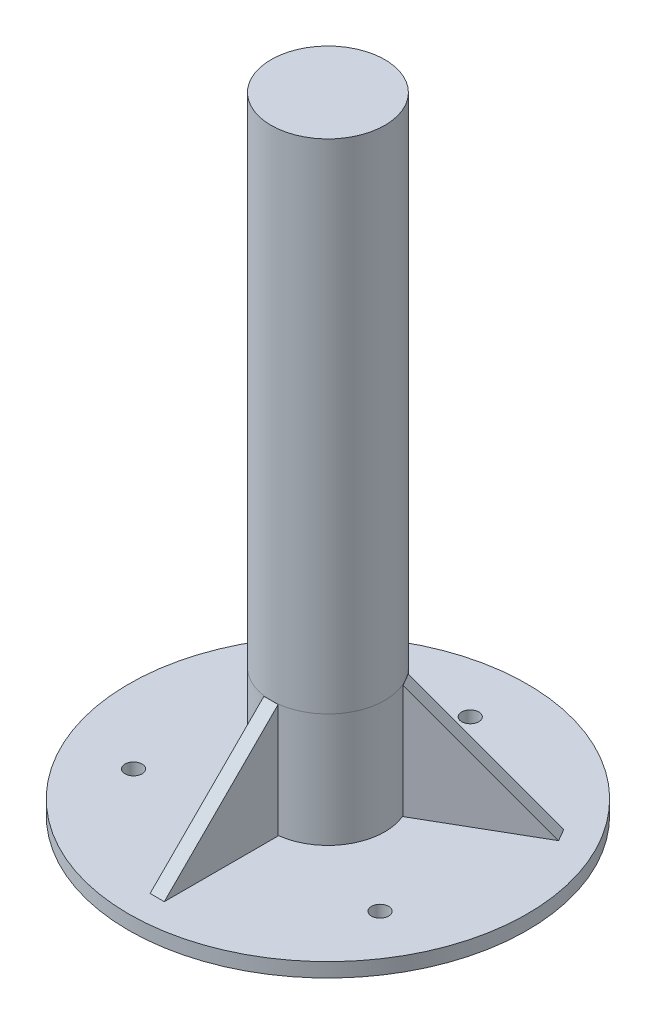
ISO-10303-21;
HEADER;
FILE_DESCRIPTION(('STEP AP214'),'2;1');
FILE_NAME('part.step','',(''),(''),'','','');
FILE_SCHEMA(('AUTOMOTIVE_DESIGN { 1 0 10303 214 1 1 1 1 }'));
ENDSEC;
DATA;
#1=APPLICATION_CONTEXT('core data for automotive mechanical design processes');
#2=APPLICATION_PROTOCOL_DEFINITION('international standard','automotive_design',2000,#1);
#3=PRODUCT_CONTEXT('',#1,'mechanical');
#4=PRODUCT('Part','Part','',(#3));
#5=PRODUCT_RELATED_PRODUCT_CATEGORY('part','',(#4));
#6=PRODUCT_DEFINITION_FORMATION('','',#4);
#7=PRODUCT_DEFINITION_CONTEXT('part definition',#1,'design');
#8=PRODUCT_DEFINITION('design','',#6,#7);
#9=PRODUCT_DEFINITION_SHAPE('','',#8);
#10=(LENGTH_UNIT() NAMED_UNIT(*) SI_UNIT(.MILLI.,.METRE.));
#11=(NAMED_UNIT(*) PLANE_ANGLE_UNIT() SI_UNIT($,.RADIAN.));
#12=(NAMED_UNIT(*) SI_UNIT($,.STERADIAN.) SOLID_ANGLE_UNIT());
#13=UNCERTAINTY_MEASURE_WITH_UNIT(LENGTH_MEASURE(1.E-05),#10,'distance_accuracy_value','');
#14=(GEOMETRIC_REPRESENTATION_CONTEXT(3) GLOBAL_UNCERTAINTY_ASSIGNED_CONTEXT((#13)) GLOBAL_UNIT_ASSIGNED_CONTEXT((#10,
#11,#12)) REPRESENTATION_CONTEXT('',''));
#15=CARTESIAN_POINT('',(0.,0.,0.));
#16=DIRECTION('',(0.,0.,1.));
#17=DIRECTION('',(1.,0.,0.));
#18=AXIS2_PLACEMENT_3D('',#15,#16,#17);
#19=CARTESIAN_POINT('',(-2.5,40.,20.));
#20=DIRECTION('',(0.,0.707106781186544,0.707106781186551));
#21=DIRECTION('',(0.,-0.707106781186551,0.707106781186544));
#22=AXIS2_PLACEMENT_3D('',#19,#20,#21);
#23=PLANE('',#22);
#24=DIRECTION('',(1.,0.,0.));
#25=VECTOR('',#24,1.);
#26=CARTESIAN_POINT('',(-2.5,0.,59.9999999999996));
#27=LINE('',#26,#25);
#28=CARTESIAN_POINT('',(-2.5,0.,59.9999999999996));
#29=VERTEX_POINT('',#28);
#30=CARTESIAN_POINT('',(2.5,0.,59.9999999999996));
#31=VERTEX_POINT('',#30);
#32=EDGE_CURVE('E48',#29,#31,#27,.T.);
#33=ORIENTED_EDGE('',*,*,#32,.T.);
#34=DIRECTION('',(0.,-0.707106781186551,0.707106781186544));
#35=VECTOR('',#34,1.);
#36=CARTESIAN_POINT('',(2.5,40.,20.));
#37=LINE('',#36,#35);
#38=CARTESIAN_POINT('',(2.5,40.,20.));
#39=VERTEX_POINT('',#38);
#40=EDGE_CURVE('E79',#39,#31,#37,.T.);
#41=ORIENTED_EDGE('',*,*,#40,.F.);
#42=DIRECTION('',(1.,0.,0.));
#43=VECTOR('',#42,1.);
#44=CARTESIAN_POINT('',(-2.5,40.,20.));
#45=LINE('',#44,#43);
#46=CARTESIAN_POINT('',(-2.5,40.,20.));
#47=VERTEX_POINT('',#46);
#48=EDGE_CURVE('E12',#47,#39,#45,.T.);
#49=ORIENTED_EDGE('',*,*,#48,.F.);
#50=DIRECTION('',(0.,-0.707106781186551,0.707106781186544));
#51=VECTOR('',#50,1.);
#52=CARTESIAN_POINT('',(-2.5,40.,20.));
#53=LINE('',#52,#51);
#54=EDGE_CURVE('E80',#47,#29,#53,.T.);
#55=ORIENTED_EDGE('',*,*,#54,.T.);
#56=EDGE_LOOP('',(#33,#41,#49,#55));
#57=FACE_BOUND('',#56,.T.);
#58=ADVANCED_FACE('F45',(#57),#23,.T.);
#59=CARTESIAN_POINT('',(-2.5,0.,20.));
#60=DIRECTION('',(0.,0.,-1.));
#61=DIRECTION('',(-1.,0.,0.));
#62=AXIS2_PLACEMENT_3D('',#59,#60,#61);
#63=PLANE('',#62);
#64=ORIENTED_EDGE('',*,*,#48,.T.);
#65=DIRECTION('',(0.,1.,0.));
#66=VECTOR('',#65,1.);
#67=CARTESIAN_POINT('',(2.5,0.,20.));
#68=LINE('',#67,#66);
#69=CARTESIAN_POINT('',(2.5,0.,20.));
#70=VERTEX_POINT('',#69);
#71=EDGE_CURVE('E89',#70,#39,#68,.T.);
#72=ORIENTED_EDGE('',*,*,#71,.F.);
#73=DIRECTION('',(1.,0.,0.));
#74=VECTOR('',#73,1.);
#75=CARTESIAN_POINT('',(-2.5,0.,20.));
#76=LINE('',#75,#74);
#77=CARTESIAN_POINT('',(-2.5,0.,20.));
#78=VERTEX_POINT('',#77);
#79=EDGE_CURVE('E53',#78,#70,#76,.T.);
#80=ORIENTED_EDGE('',*,*,#79,.F.);
#81=DIRECTION('',(0.,1.,0.));
#82=VECTOR('',#81,1.);
#83=CARTESIAN_POINT('',(-2.5,0.,20.));
#84=LINE('',#83,#82);
#85=EDGE_CURVE('E83',#78,#47,#84,.T.);
#86=ORIENTED_EDGE('',*,*,#85,.T.);
#87=EDGE_LOOP('',(#64,#72,#80,#86));
#88=FACE_BOUND('',#87,.T.);
#89=ADVANCED_FACE('F99',(#88),#63,.T.);
#90=CARTESIAN_POINT('',(-2.5,0.,59.9999999999996));
#91=DIRECTION('',(0.,-1.,0.));
#92=DIRECTION('',(0.,0.,-1.));
#93=AXIS2_PLACEMENT_3D('',#90,#91,#92);
#94=PLANE('',#93);
#95=ORIENTED_EDGE('',*,*,#79,.T.);
#96=DIRECTION('',(0.,0.,-1.));
#97=VECTOR('',#96,1.);
#98=CARTESIAN_POINT('',(2.5,0.,59.9999999999996));
#99=LINE('',#98,#97);
#100=EDGE_CURVE('E85',#31,#70,#99,.T.);
#101=ORIENTED_EDGE('',*,*,#100,.F.);
#102=ORIENTED_EDGE('',*,*,#32,.F.);
#103=DIRECTION('',(0.,0.,-1.));
#104=VECTOR('',#103,1.);
#105=CARTESIAN_POINT('',(-2.5,0.,59.9999999999996));
#106=LINE('',#105,#104);
#107=EDGE_CURVE('E96',#29,#78,#106,.T.);
#108=ORIENTED_EDGE('',*,*,#107,.T.);
#109=EDGE_LOOP('',(#95,#101,#102,#108));
#110=FACE_BOUND('',#109,.T.);
#111=ADVANCED_FACE('F86',(#110),#94,.T.);
#112=CARTESIAN_POINT('',(-2.5,0.,0.));
#113=DIRECTION('',(1.,0.,0.));
#114=DIRECTION('',(0.,0.,-1.));
#115=AXIS2_PLACEMENT_3D('',#112,#113,#114);
#116=PLANE('',#115);
#117=ORIENTED_EDGE('',*,*,#54,.F.);
#118=ORIENTED_EDGE('',*,*,#85,.F.);
#119=ORIENTED_EDGE('',*,*,#107,.F.);
#120=EDGE_LOOP('',(#117,#118,#119));
#121=FACE_BOUND('',#120,.T.);
#122=ADVANCED_FACE('F101',(#121),#116,.F.);
#123=CARTESIAN_POINT('',(2.5,0.,0.));
#124=DIRECTION('',(1.,0.,0.));
#125=DIRECTION('',(0.,0.,-1.));
#126=AXIS2_PLACEMENT_3D('',#123,#124,#125);
#127=PLANE('',#126);
#128=ORIENTED_EDGE('',*,*,#40,.T.);
#129=ORIENTED_EDGE('',*,*,#100,.T.);
#130=ORIENTED_EDGE('',*,*,#71,.T.);
#131=EDGE_LOOP('',(#128,#129,#130));
#132=FACE_BOUND('',#131,.T.);
#133=ADVANCED_FACE('F91',(#132),#127,.T.);
#134=CLOSED_SHELL('',(#58,#89,#111,#122,#133));
#135=MANIFOLD_SOLID_BREP('B2',#134);
#136=CARTESIAN_POINT('',(0.,215.,0.));
#137=DIRECTION('',(0.,-1.,0.));
#138=DIRECTION('',(0.,0.,-1.));
#139=AXIS2_PLACEMENT_3D('',#136,#137,#138);
#140=CYLINDRICAL_SURFACE('',#139,20.);
#141=CARTESIAN_POINT('',(0.,215.,0.));
#142=DIRECTION('',(0.,1.,0.));
#143=DIRECTION('',(0.,0.,1.));
#144=AXIS2_PLACEMENT_3D('',#141,#142,#143);
#145=CIRCLE('',#144,20.);
#146=CARTESIAN_POINT('',(0.,215.,20.));
#147=VERTEX_POINT('',#146);
#148=EDGE_CURVE('E43',#147,#147,#145,.T.);
#149=ORIENTED_EDGE('',*,*,#148,.F.);
#150=EDGE_LOOP('',(#149));
#151=FACE_BOUND('',#150,.T.);
#152=CARTESIAN_POINT('',(0.,40.,0.));
#153=DIRECTION('',(0.,1.,0.));
#154=DIRECTION('',(0.,0.,1.));
#155=AXIS2_PLACEMENT_3D('',#152,#153,#154);
#156=CIRCLE('',#155,20.);
#157=CARTESIAN_POINT('',(-17.3205080756887,40.,-10.0000000000001));
#158=VERTEX_POINT('',#157);
#159=CARTESIAN_POINT('',(17.3205080756889,40.,-9.99999999999984));
#160=VERTEX_POINT('',#159);
#161=EDGE_CURVE('E153',#158,#160,#156,.T.);
#162=ORIENTED_EDGE('',*,*,#161,.T.);
#163=EDGE_CURVE('E163',#160,#158,#156,.T.);
#164=ORIENTED_EDGE('',*,*,#163,.T.);
#165=EDGE_LOOP('',(#162,#164));
#166=FACE_BOUND('',#165,.T.);
#167=ADVANCED_FACE('F150',(#151,#166),#140,.T.);
#168=CARTESIAN_POINT('',(0.,215.,0.));
#169=DIRECTION('',(0.,1.,0.));
#170=DIRECTION('',(0.,0.,1.));
#171=AXIS2_PLACEMENT_3D('',#168,#169,#170);
#172=PLANE('',#171);
#173=ORIENTED_EDGE('',*,*,#148,.T.);
#174=EDGE_LOOP('',(#173));
#175=FACE_BOUND('',#174,.T.);
#176=ADVANCED_FACE('F168',(#175),#172,.T.);
#177=CARTESIAN_POINT('',(0.,40.,0.));
#178=DIRECTION('',(0.,1.,0.));
#179=DIRECTION('',(0.,0.,1.));
#180=AXIS2_PLACEMENT_3D('',#177,#178,#179);
#181=PLANE('',#180);
#182=ORIENTED_EDGE('',*,*,#161,.F.);
#183=ORIENTED_EDGE('',*,*,#163,.F.);
#184=EDGE_LOOP('',(#182,#183));
#185=FACE_BOUND('',#184,.T.);
#186=ADVANCED_FACE('F166',(#185),#181,.F.);
#187=CLOSED_SHELL('',(#167,#176,#186));
#188=MANIFOLD_SOLID_BREP('B6',#187);
#189=CARTESIAN_POINT('',(0.,40.,0.));
#190=DIRECTION('',(0.,-1.,0.));
#191=DIRECTION('',(0.,0.,-1.));
#192=AXIS2_PLACEMENT_3D('',#189,#190,#191);
#193=CYLINDRICAL_SURFACE('',#192,20.);
#194=CARTESIAN_POINT('',(0.,0.,0.));
#195=DIRECTION('',(0.,1.,0.));
#196=DIRECTION('',(0.,0.,1.));
#197=AXIS2_PLACEMENT_3D('',#194,#195,#196);
#198=CIRCLE('',#197,20.);
#199=CARTESIAN_POINT('',(0.,0.,20.));
#200=VERTEX_POINT('',#199);
#201=EDGE_CURVE('E207',#200,#200,#198,.T.);
#202=ORIENTED_EDGE('',*,*,#201,.T.);
#203=EDGE_LOOP('',(#202));
#204=FACE_BOUND('',#203,.T.);
#205=CARTESIAN_POINT('',(0.,40.,0.));
#206=DIRECTION('',(0.,1.,0.));
#207=DIRECTION('',(0.,0.,1.));
#208=AXIS2_PLACEMENT_3D('',#205,#206,#207);
#209=CIRCLE('',#208,20.);
#210=CARTESIAN_POINT('',(0.,40.,20.));
#211=VERTEX_POINT('',#210);
#212=EDGE_CURVE('E149',#211,#211,#209,.T.);
#213=ORIENTED_EDGE('',*,*,#212,.F.);
#214=EDGE_LOOP('',(#213));
#215=FACE_BOUND('',#214,.T.);
#216=ADVANCED_FACE('F204',(#204,#215),#193,.T.);
#217=CARTESIAN_POINT('',(0.,40.,0.));
#218=DIRECTION('',(0.,1.,0.));
#219=DIRECTION('',(0.,0.,1.));
#220=AXIS2_PLACEMENT_3D('',#217,#218,#219);
#221=PLANE('',#220);
#222=ORIENTED_EDGE('',*,*,#212,.T.);
#223=EDGE_LOOP('',(#222));
#224=FACE_BOUND('',#223,.T.);
#225=ADVANCED_FACE('F220',(#224),#221,.T.);
#226=CARTESIAN_POINT('',(0.,0.,0.));
#227=DIRECTION('',(0.,1.,0.));
#228=DIRECTION('',(0.,0.,1.));
#229=AXIS2_PLACEMENT_3D('',#226,#227,#228);
#230=PLANE('',#229);
#231=ORIENTED_EDGE('',*,*,#201,.F.);
#232=EDGE_LOOP('',(#231));
#233=FACE_BOUND('',#232,.T.);
#234=ADVANCED_FACE('F218',(#233),#230,.F.);
#235=CLOSED_SHELL('',(#216,#225,#234));
#236=MANIFOLD_SOLID_BREP('B37',#235);
#237=CARTESIAN_POINT('',(0.,0.,0.));
#238=DIRECTION('',(0.,1.,0.));
#239=DIRECTION('',(0.,0.,1.));
#240=AXIS2_PLACEMENT_3D('',#237,#238,#239);
#241=PLANE('',#240);
#242=CARTESIAN_POINT('',(0.,0.,-50.));
#243=DIRECTION('',(0.,1.,0.));
#244=DIRECTION('',(0.,0.,1.));
#245=AXIS2_PLACEMENT_3D('',#242,#243,#244);
#246=CIRCLE('',#245,3.);
#247=CARTESIAN_POINT('',(0.,0.,-47.));
#248=VERTEX_POINT('',#247);
#249=EDGE_CURVE('E415',#248,#248,#246,.T.);
#250=ORIENTED_EDGE('',*,*,#249,.F.);
#251=EDGE_LOOP('',(#250));
#252=FACE_BOUND('',#251,.T.);
#253=CARTESIAN_POINT('',(43.3012701892241,0.,24.9999999999988));
#254=DIRECTION('',(0.,1.,0.));
#255=DIRECTION('',(0.,0.,1.));
#256=AXIS2_PLACEMENT_3D('',#253,#254,#255);
#257=CIRCLE('',#256,3.0000000000019);
#258=CARTESIAN_POINT('',(43.3012701892241,0.,28.0000000000007));
#259=VERTEX_POINT('',#258);
#260=EDGE_CURVE('E420',#259,#259,#257,.T.);
#261=ORIENTED_EDGE('',*,*,#260,.F.);
#262=EDGE_LOOP('',(#261));
#263=FACE_BOUND('',#262,.T.);
#264=CARTESIAN_POINT('',(-43.3012701892198,0.,25.0000000000012));
#265=DIRECTION('',(0.,1.,0.));
#266=DIRECTION('',(0.,0.,1.));
#267=AXIS2_PLACEMENT_3D('',#264,#265,#266);
#268=CIRCLE('',#267,3.00000000000286);
#269=CARTESIAN_POINT('',(-43.3012701892198,0.,28.0000000000041));
#270=VERTEX_POINT('',#269);
#271=EDGE_CURVE('E428',#270,#270,#268,.T.);
#272=ORIENTED_EDGE('',*,*,#271,.F.);
#273=EDGE_LOOP('',(#272));
#274=FACE_BOUND('',#273,.T.);
#275=CARTESIAN_POINT('',(0.,0.,0.));
#276=DIRECTION('',(0.,1.,0.));
#277=DIRECTION('',(0.,0.,1.));
#278=AXIS2_PLACEMENT_3D('',#275,#276,#277);
#279=CIRCLE('',#278,70.);
#280=CARTESIAN_POINT('',(0.,0.,70.));
#281=VERTEX_POINT('',#280);
#282=EDGE_CURVE('E248',#281,#281,#279,.T.);
#283=ORIENTED_EDGE('',*,*,#282,.T.);
#284=EDGE_LOOP('',(#283));
#285=FACE_BOUND('',#284,.T.);
#286=DIRECTION('',(-0.500000000000004,0.,0.866025403784436));
#287=VECTOR('',#286,1.);
#288=CARTESIAN_POINT('',(-50.7115242270658,0.,-32.1650635094611));
#289=LINE('',#288,#287);
#290=CARTESIAN_POINT('',(-50.7115242270658,0.,-32.1650635094611));
#291=VERTEX_POINT('',#290);
#292=CARTESIAN_POINT('',(-53.2115242270658,0.,-27.8349364905389));
#293=VERTEX_POINT('',#292);
#294=EDGE_CURVE('E323',#291,#293,#289,.T.);
#295=ORIENTED_EDGE('',*,*,#294,.F.);
#296=DIRECTION('',(0.866025403784436,0.,0.500000000000004));
#297=VECTOR('',#296,1.);
#298=CARTESIAN_POINT('',(-50.7115242270658,0.,-32.1650635094611));
#299=LINE('',#298,#297);
#300=CARTESIAN_POINT('',(-16.0705080756887,0.,-12.1650635094612));
#301=VERTEX_POINT('',#300);
#302=EDGE_CURVE('E346',#291,#301,#299,.T.);
#303=ORIENTED_EDGE('',*,*,#302,.T.);
#304=DIRECTION('',(-0.500000000000004,0.,0.866025403784436));
#305=VECTOR('',#304,1.);
#306=CARTESIAN_POINT('',(-16.0705080756887,0.,-12.1650635094612));
#307=LINE('',#306,#305);
#308=CARTESIAN_POINT('',(-18.5705080756887,0.,-7.83493649053899));
#309=VERTEX_POINT('',#308);
#310=EDGE_CURVE('E338',#301,#309,#307,.T.);
#311=ORIENTED_EDGE('',*,*,#310,.T.);
#312=DIRECTION('',(0.866025403784436,0.,0.500000000000004));
#313=VECTOR('',#312,1.);
#314=CARTESIAN_POINT('',(-53.2115242270658,0.,-27.8349364905389));
#315=LINE('',#314,#313);
#316=EDGE_CURVE('E343',#293,#309,#315,.T.);
#317=ORIENTED_EDGE('',*,*,#316,.F.);
#318=EDGE_LOOP('',(#295,#303,#311,#317));
#319=FACE_BOUND('',#318,.T.);
#320=DIRECTION('',(-0.499999999999992,0.,-0.866025403784443));
#321=VECTOR('',#320,1.);
#322=CARTESIAN_POINT('',(53.2115242270662,0.,-27.8349364905382));
#323=LINE('',#322,#321);
#324=CARTESIAN_POINT('',(53.2115242270662,0.,-27.8349364905382));
#325=VERTEX_POINT('',#324);
#326=CARTESIAN_POINT('',(50.7115242270662,0.,-32.1650635094604));
#327=VERTEX_POINT('',#326);
#328=EDGE_CURVE('E259',#325,#327,#323,.T.);
#329=ORIENTED_EDGE('',*,*,#328,.F.);
#330=DIRECTION('',(-0.866025403784443,0.,0.499999999999992));
#331=VECTOR('',#330,1.);
#332=CARTESIAN_POINT('',(53.2115242270662,0.,-27.8349364905382));
#333=LINE('',#332,#331);
#334=CARTESIAN_POINT('',(18.5705080756888,0.,-7.83493649053873));
#335=VERTEX_POINT('',#334);
#336=EDGE_CURVE('E264',#325,#335,#333,.T.);
#337=ORIENTED_EDGE('',*,*,#336,.T.);
#338=DIRECTION('',(-0.499999999999992,0.,-0.866025403784443));
#339=VECTOR('',#338,1.);
#340=CARTESIAN_POINT('',(18.5705080756888,0.,-7.83493649053873));
#341=LINE('',#340,#339);
#342=CARTESIAN_POINT('',(16.0705080756889,0.,-12.1650635094609));
#343=VERTEX_POINT('',#342);
#344=EDGE_CURVE('E315',#335,#343,#341,.T.);
#345=ORIENTED_EDGE('',*,*,#344,.T.);
#346=DIRECTION('',(-0.866025403784443,0.,0.499999999999992));
#347=VECTOR('',#346,1.);
#348=CARTESIAN_POINT('',(50.7115242270662,0.,-32.1650635094604));
#349=LINE('',#348,#347);
#350=EDGE_CURVE('E314',#327,#343,#349,.T.);
#351=ORIENTED_EDGE('',*,*,#350,.F.);
#352=EDGE_LOOP('',(#329,#337,#345,#351));
#353=FACE_BOUND('',#352,.T.);
#354=ADVANCED_FACE('F244',(#252,#263,#274,#285,#319,#353),#241,.T.);
#355=CARTESIAN_POINT('',(0.,-5.,0.));
#356=DIRECTION('',(0.,1.,0.));
#357=DIRECTION('',(0.,0.,1.));
#358=AXIS2_PLACEMENT_3D('',#355,#356,#357);
#359=CYLINDRICAL_SURFACE('',#358,70.);
#360=CARTESIAN_POINT('',(0.,-5.,0.));
#361=DIRECTION('',(0.,1.,0.));
#362=DIRECTION('',(0.,0.,1.));
#363=AXIS2_PLACEMENT_3D('',#360,#361,#362);
#364=CIRCLE('',#363,70.);
#365=CARTESIAN_POINT('',(0.,-5.,70.));
#366=VERTEX_POINT('',#365);
#367=EDGE_CURVE('E202',#366,#366,#364,.T.);
#368=ORIENTED_EDGE('',*,*,#367,.T.);
#369=EDGE_LOOP('',(#368));
#370=FACE_BOUND('',#369,.T.);
#371=ORIENTED_EDGE('',*,*,#282,.F.);
#372=EDGE_LOOP('',(#371));
#373=FACE_BOUND('',#372,.T.);
#374=ADVANCED_FACE('F246',(#370,#373),#359,.T.);
#375=CARTESIAN_POINT('',(0.,-5.,0.));
#376=DIRECTION('',(0.,1.,0.));
#377=DIRECTION('',(0.,0.,1.));
#378=AXIS2_PLACEMENT_3D('',#375,#376,#377);
#379=PLANE('',#378);
#380=CARTESIAN_POINT('',(0.,-5.,-50.));
#381=DIRECTION('',(0.,1.,0.));
#382=DIRECTION('',(0.,0.,1.));
#383=AXIS2_PLACEMENT_3D('',#380,#381,#382);
#384=CIRCLE('',#383,3.);
#385=CARTESIAN_POINT('',(0.,-5.,-47.));
#386=VERTEX_POINT('',#385);
#387=EDGE_CURVE('E413',#386,#386,#384,.T.);
#388=ORIENTED_EDGE('',*,*,#387,.T.);
#389=EDGE_LOOP('',(#388));
#390=FACE_BOUND('',#389,.T.);
#391=CARTESIAN_POINT('',(43.3012701892241,-5.,24.9999999999988));
#392=DIRECTION('',(0.,1.,0.));
#393=DIRECTION('',(0.,0.,1.));
#394=AXIS2_PLACEMENT_3D('',#391,#392,#393);
#395=CIRCLE('',#394,3.0000000000019);
#396=CARTESIAN_POINT('',(43.3012701892241,-5.,28.0000000000007));
#397=VERTEX_POINT('',#396);
#398=EDGE_CURVE('E416',#397,#397,#395,.T.);
#399=ORIENTED_EDGE('',*,*,#398,.T.);
#400=EDGE_LOOP('',(#399));
#401=FACE_BOUND('',#400,.T.);
#402=CARTESIAN_POINT('',(-43.3012701892198,-5.,25.0000000000012));
#403=DIRECTION('',(0.,1.,0.));
#404=DIRECTION('',(0.,0.,1.));
#405=AXIS2_PLACEMENT_3D('',#402,#403,#404);
#406=CIRCLE('',#405,3.00000000000286);
#407=CARTESIAN_POINT('',(-43.3012701892198,-5.,28.0000000000041));
#408=VERTEX_POINT('',#407);
#409=EDGE_CURVE('E425',#408,#408,#406,.T.);
#410=ORIENTED_EDGE('',*,*,#409,.T.);
#411=EDGE_LOOP('',(#410));
#412=FACE_BOUND('',#411,.T.);
#413=ORIENTED_EDGE('',*,*,#367,.F.);
#414=EDGE_LOOP('',(#413));
#415=FACE_BOUND('',#414,.T.);
#416=ADVANCED_FACE('F355',(#390,#401,#412,#415),#379,.F.);
#417=CARTESIAN_POINT('',(-16.0705080756887,40.,-12.1650635094612));
#418=DIRECTION('',(-0.612372435695796,0.707106781186544,-0.353553390593279));
#419=DIRECTION('',(-0.61237243569579,-0.707106781186551,-0.353553390593275));
#420=AXIS2_PLACEMENT_3D('',#417,#418,#419);
#421=PLANE('',#420);
#422=ORIENTED_EDGE('',*,*,#294,.T.);
#423=DIRECTION('',(-0.61237243569579,-0.707106781186551,-0.353553390593275));
#424=VECTOR('',#423,1.);
#425=CARTESIAN_POINT('',(-18.5705080756887,40.,-7.83493649053899));
#426=LINE('',#425,#424);
#427=CARTESIAN_POINT('',(-18.5705080756887,40.,-7.83493649053899));
#428=VERTEX_POINT('',#427);
#429=EDGE_CURVE('E326',#428,#293,#426,.T.);
#430=ORIENTED_EDGE('',*,*,#429,.F.);
#431=DIRECTION('',(-0.500000000000004,0.,0.866025403784436));
#432=VECTOR('',#431,1.);
#433=CARTESIAN_POINT('',(-16.0705080756887,40.,-12.1650635094612));
#434=LINE('',#433,#432);
#435=CARTESIAN_POINT('',(-16.0705080756887,40.,-12.1650635094612));
#436=VERTEX_POINT('',#435);
#437=EDGE_CURVE('E329',#436,#428,#434,.T.);
#438=ORIENTED_EDGE('',*,*,#437,.F.);
#439=DIRECTION('',(-0.61237243569579,-0.707106781186551,-0.353553390593275));
#440=VECTOR('',#439,1.);
#441=CARTESIAN_POINT('',(-16.0705080756887,40.,-12.1650635094612));
#442=LINE('',#441,#440);
#443=EDGE_CURVE('E332',#436,#291,#442,.T.);
#444=ORIENTED_EDGE('',*,*,#443,.T.);
#445=EDGE_LOOP('',(#422,#430,#438,#444));
#446=FACE_BOUND('',#445,.T.);
#447=ADVANCED_FACE('F361',(#446),#421,.T.);
#448=CARTESIAN_POINT('',(-16.0705080756887,0.,-12.1650635094612));
#449=DIRECTION('',(0.866025403784436,0.,0.500000000000004));
#450=DIRECTION('',(0.500000000000004,0.,-0.866025403784436));
#451=AXIS2_PLACEMENT_3D('',#448,#449,#450);
#452=PLANE('',#451);
#453=ORIENTED_EDGE('',*,*,#437,.T.);
#454=DIRECTION('',(0.,1.,0.));
#455=VECTOR('',#454,1.);
#456=CARTESIAN_POINT('',(-18.5705080756887,0.,-7.83493649053899));
#457=LINE('',#456,#455);
#458=EDGE_CURVE('E335',#309,#428,#457,.T.);
#459=ORIENTED_EDGE('',*,*,#458,.F.);
#460=ORIENTED_EDGE('',*,*,#310,.F.);
#461=DIRECTION('',(0.,1.,0.));
#462=VECTOR('',#461,1.);
#463=CARTESIAN_POINT('',(-16.0705080756887,0.,-12.1650635094612));
#464=LINE('',#463,#462);
#465=EDGE_CURVE('E340',#301,#436,#464,.T.);
#466=ORIENTED_EDGE('',*,*,#465,.T.);
#467=EDGE_LOOP('',(#453,#459,#460,#466));
#468=FACE_BOUND('',#467,.T.);
#469=ADVANCED_FACE('F379',(#468),#452,.T.);
#470=CARTESIAN_POINT('',(1.25000000000001,0.,-2.16506350946109));
#471=DIRECTION('',(-0.500000000000004,0.,0.866025403784436));
#472=DIRECTION('',(0.866025403784436,0.,0.500000000000004));
#473=AXIS2_PLACEMENT_3D('',#470,#471,#472);
#474=PLANE('',#473);
#475=ORIENTED_EDGE('',*,*,#443,.F.);
#476=ORIENTED_EDGE('',*,*,#465,.F.);
#477=ORIENTED_EDGE('',*,*,#302,.F.);
#478=EDGE_LOOP('',(#475,#476,#477));
#479=FACE_BOUND('',#478,.T.);
#480=ADVANCED_FACE('F375',(#479),#474,.F.);
#481=CARTESIAN_POINT('',(-1.25000000000001,0.,2.16506350946109));
#482=DIRECTION('',(-0.500000000000004,0.,0.866025403784436));
#483=DIRECTION('',(0.866025403784436,0.,0.500000000000004));
#484=AXIS2_PLACEMENT_3D('',#481,#482,#483);
#485=PLANE('',#484);
#486=ORIENTED_EDGE('',*,*,#429,.T.);
#487=ORIENTED_EDGE('',*,*,#316,.T.);
#488=ORIENTED_EDGE('',*,*,#458,.T.);
#489=EDGE_LOOP('',(#486,#487,#488));
#490=FACE_BOUND('',#489,.T.);
#491=ADVANCED_FACE('F364',(#490),#485,.T.);
#492=CARTESIAN_POINT('',(18.5705080756888,40.,-7.83493649053873));
#493=DIRECTION('',(0.612372435695801,0.707106781186544,-0.35355339059327));
#494=DIRECTION('',(0.612372435695794,-0.707106781186551,-0.353553390593266));
#495=AXIS2_PLACEMENT_3D('',#492,#493,#494);
#496=PLANE('',#495);
#497=ORIENTED_EDGE('',*,*,#328,.T.);
#498=DIRECTION('',(0.612372435695794,-0.707106781186551,-0.353553390593266));
#499=VECTOR('',#498,1.);
#500=CARTESIAN_POINT('',(16.0705080756889,40.,-12.1650635094609));
#501=LINE('',#500,#499);
#502=CARTESIAN_POINT('',(16.0705080756889,40.,-12.1650635094609));
#503=VERTEX_POINT('',#502);
#504=EDGE_CURVE('E295',#503,#327,#501,.T.);
#505=ORIENTED_EDGE('',*,*,#504,.F.);
#506=DIRECTION('',(-0.499999999999992,0.,-0.866025403784443));
#507=VECTOR('',#506,1.);
#508=CARTESIAN_POINT('',(18.5705080756888,40.,-7.83493649053873));
#509=LINE('',#508,#507);
#510=CARTESIAN_POINT('',(18.5705080756888,40.,-7.83493649053873));
#511=VERTEX_POINT('',#510);
#512=EDGE_CURVE('E298',#511,#503,#509,.T.);
#513=ORIENTED_EDGE('',*,*,#512,.F.);
#514=DIRECTION('',(0.612372435695794,-0.707106781186551,-0.353553390593266));
#515=VECTOR('',#514,1.);
#516=CARTESIAN_POINT('',(18.5705080756888,40.,-7.83493649053873));
#517=LINE('',#516,#515);
#518=EDGE_CURVE('E311',#511,#325,#517,.T.);
#519=ORIENTED_EDGE('',*,*,#518,.T.);
#520=EDGE_LOOP('',(#497,#505,#513,#519));
#521=FACE_BOUND('',#520,.T.);
#522=ADVANCED_FACE('F297',(#521),#496,.T.);
#523=CARTESIAN_POINT('',(18.5705080756888,0.,-7.83493649053873));
#524=DIRECTION('',(-0.866025403784443,0.,0.499999999999992));
#525=DIRECTION('',(0.499999999999992,0.,0.866025403784443));
#526=AXIS2_PLACEMENT_3D('',#523,#524,#525);
#527=PLANE('',#526);
#528=ORIENTED_EDGE('',*,*,#512,.T.);
#529=DIRECTION('',(0.,1.,0.));
#530=VECTOR('',#529,1.);
#531=CARTESIAN_POINT('',(16.0705080756889,0.,-12.1650635094609));
#532=LINE('',#531,#530);
#533=EDGE_CURVE('E308',#343,#503,#532,.T.);
#534=ORIENTED_EDGE('',*,*,#533,.F.);
#535=ORIENTED_EDGE('',*,*,#344,.F.);
#536=DIRECTION('',(0.,1.,0.));
#537=VECTOR('',#536,1.);
#538=CARTESIAN_POINT('',(18.5705080756888,0.,-7.83493649053873));
#539=LINE('',#538,#537);
#540=EDGE_CURVE('E310',#335,#511,#539,.T.);
#541=ORIENTED_EDGE('',*,*,#540,.T.);
#542=EDGE_LOOP('',(#528,#534,#535,#541));
#543=FACE_BOUND('',#542,.T.);
#544=ADVANCED_FACE('F307',(#543),#527,.T.);
#545=CARTESIAN_POINT('',(1.24999999999998,0.,2.16506350946111));
#546=DIRECTION('',(-0.499999999999992,0.,-0.866025403784443));
#547=DIRECTION('',(-0.866025403784443,0.,0.499999999999992));
#548=AXIS2_PLACEMENT_3D('',#545,#546,#547);
#549=PLANE('',#548);
#550=ORIENTED_EDGE('',*,*,#518,.F.);
#551=ORIENTED_EDGE('',*,*,#540,.F.);
#552=ORIENTED_EDGE('',*,*,#336,.F.);
#553=EDGE_LOOP('',(#550,#551,#552));
#554=FACE_BOUND('',#553,.T.);
#555=ADVANCED_FACE('F390',(#554),#549,.F.);
#556=CARTESIAN_POINT('',(-1.24999999999998,0.,-2.16506350946111));
#557=DIRECTION('',(-0.499999999999992,0.,-0.866025403784443));
#558=DIRECTION('',(-0.866025403784443,0.,0.499999999999992));
#559=AXIS2_PLACEMENT_3D('',#556,#557,#558);
#560=PLANE('',#559);
#561=ORIENTED_EDGE('',*,*,#504,.T.);
#562=ORIENTED_EDGE('',*,*,#350,.T.);
#563=ORIENTED_EDGE('',*,*,#533,.T.);
#564=EDGE_LOOP('',(#561,#562,#563));
#565=FACE_BOUND('',#564,.T.);
#566=ADVANCED_FACE('F313',(#565),#560,.T.);
#567=CARTESIAN_POINT('',(-43.3012701892198,-5.,25.0000000000012));
#568=DIRECTION('',(0.,1.,0.));
#569=DIRECTION('',(0.,0.,1.));
#570=AXIS2_PLACEMENT_3D('',#567,#568,#569);
#571=CYLINDRICAL_SURFACE('',#570,3.00000000000286);
#572=ORIENTED_EDGE('',*,*,#409,.F.);
#573=EDGE_LOOP('',(#572));
#574=FACE_BOUND('',#573,.T.);
#575=ORIENTED_EDGE('',*,*,#271,.T.);
#576=EDGE_LOOP('',(#575));
#577=FACE_BOUND('',#576,.T.);
#578=ADVANCED_FACE('F389',(#574,#577),#571,.F.);
#579=CARTESIAN_POINT('',(43.3012701892241,-5.,24.9999999999988));
#580=DIRECTION('',(0.,1.,0.));
#581=DIRECTION('',(0.,0.,1.));
#582=AXIS2_PLACEMENT_3D('',#579,#580,#581);
#583=CYLINDRICAL_SURFACE('',#582,3.0000000000019);
#584=ORIENTED_EDGE('',*,*,#398,.F.);
#585=EDGE_LOOP('',(#584));
#586=FACE_BOUND('',#585,.T.);
#587=ORIENTED_EDGE('',*,*,#260,.T.);
#588=EDGE_LOOP('',(#587));
#589=FACE_BOUND('',#588,.T.);
#590=ADVANCED_FACE('F400',(#586,#589),#583,.F.);
#591=CARTESIAN_POINT('',(0.,-5.,-50.));
#592=DIRECTION('',(0.,1.,0.));
#593=DIRECTION('',(0.,0.,1.));
#594=AXIS2_PLACEMENT_3D('',#591,#592,#593);
#595=CYLINDRICAL_SURFACE('',#594,3.);
#596=ORIENTED_EDGE('',*,*,#387,.F.);
#597=EDGE_LOOP('',(#596));
#598=FACE_BOUND('',#597,.T.);
#599=ORIENTED_EDGE('',*,*,#249,.T.);
#600=EDGE_LOOP('',(#599));
#601=FACE_BOUND('',#600,.T.);
#602=ADVANCED_FACE('F404',(#598,#601),#595,.F.);
#603=CLOSED_SHELL('',(#354,#374,#416,#447,#469,#480,#491,#522,#544,#555,#566,#578,#590,#602));
#604=MANIFOLD_SOLID_BREP('B144',#603);
#605=ADVANCED_BREP_SHAPE_REPRESENTATION('',(#18,#135,#188,#236,#604),#14);
#606=SHAPE_DEFINITION_REPRESENTATION(#9,#605);
ENDSEC;
END-ISO-10303-21;
